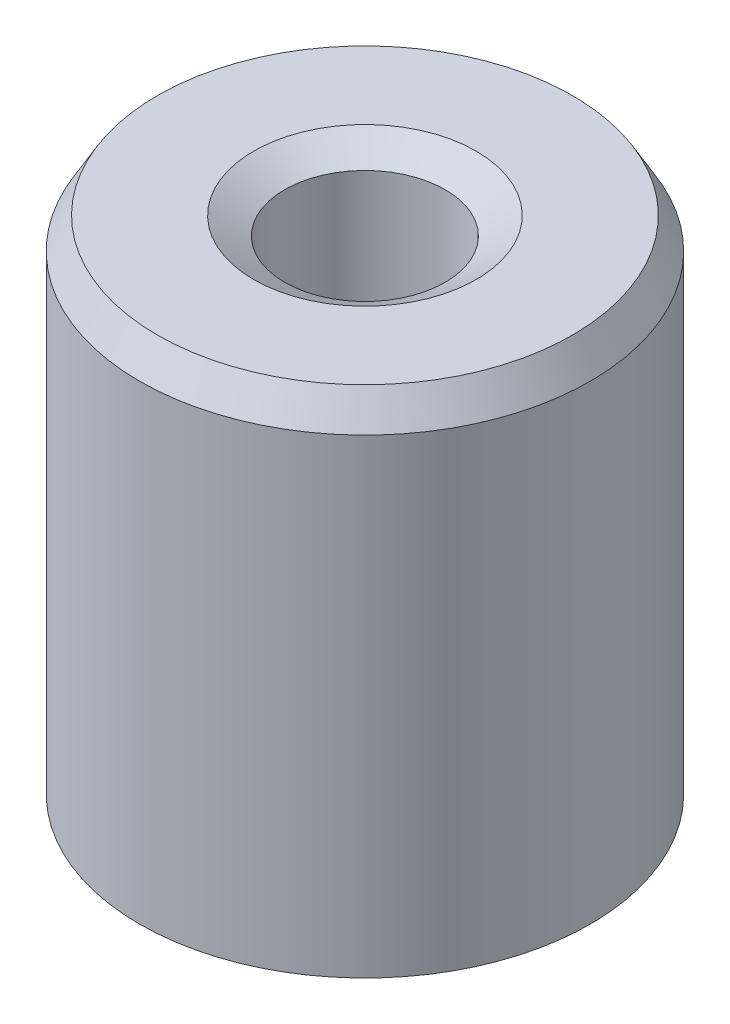
ISO-10303-21;
HEADER;
FILE_DESCRIPTION(('STEP AP214'),'2;1');
FILE_NAME('part.step','',(''),(''),'','','');
FILE_SCHEMA(('AUTOMOTIVE_DESIGN { 1 0 10303 214 1 1 1 1 }'));
ENDSEC;
DATA;
#1=APPLICATION_CONTEXT('core data for automotive mechanical design processes');
#2=APPLICATION_PROTOCOL_DEFINITION('international standard','automotive_design',2000,#1);
#3=PRODUCT_CONTEXT('',#1,'mechanical');
#4=PRODUCT('Part','Part','',(#3));
#5=PRODUCT_RELATED_PRODUCT_CATEGORY('part','',(#4));
#6=PRODUCT_DEFINITION_FORMATION('','',#4);
#7=PRODUCT_DEFINITION_CONTEXT('part definition',#1,'design');
#8=PRODUCT_DEFINITION('design','',#6,#7);
#9=PRODUCT_DEFINITION_SHAPE('','',#8);
#10=(LENGTH_UNIT() NAMED_UNIT(*) SI_UNIT(.MILLI.,.METRE.));
#11=(NAMED_UNIT(*) PLANE_ANGLE_UNIT() SI_UNIT($,.RADIAN.));
#12=(NAMED_UNIT(*) SI_UNIT($,.STERADIAN.) SOLID_ANGLE_UNIT());
#13=UNCERTAINTY_MEASURE_WITH_UNIT(LENGTH_MEASURE(1.E-05),#10,'distance_accuracy_value','');
#14=(GEOMETRIC_REPRESENTATION_CONTEXT(3) GLOBAL_UNCERTAINTY_ASSIGNED_CONTEXT((#13)) GLOBAL_UNIT_ASSIGNED_CONTEXT((#10,
#11,#12)) REPRESENTATION_CONTEXT('',''));
#15=CARTESIAN_POINT('',(0.,0.,0.));
#16=DIRECTION('',(0.,0.,1.));
#17=DIRECTION('',(1.,0.,0.));
#18=AXIS2_PLACEMENT_3D('',#15,#16,#17);
#19=CARTESIAN_POINT('',(0.,17.2736508764337,0.));
#20=DIRECTION('',(0.,-1.,0.));
#21=DIRECTION('',(0.,0.,-1.));
#22=AXIS2_PLACEMENT_3D('',#19,#20,#21);
#23=CYLINDRICAL_SURFACE('',#22,7.5);
#24=CARTESIAN_POINT('',(0.,0.595198792675698,0.));
#25=DIRECTION('',(0.,1.,0.));
#26=DIRECTION('',(0.,0.,1.));
#27=AXIS2_PLACEMENT_3D('',#24,#25,#26);
#28=CIRCLE('',#27,7.5);
#29=CARTESIAN_POINT('',(0.,0.595198792675698,7.5));
#30=VERTEX_POINT('',#29);
#31=EDGE_CURVE('E10',#30,#30,#28,.T.);
#32=ORIENTED_EDGE('',*,*,#31,.T.);
#33=EDGE_LOOP('',(#32));
#34=FACE_BOUND('',#33,.T.);
#35=CARTESIAN_POINT('',(0.,16.2427363269158,0.));
#36=DIRECTION('',(0.,1.,0.));
#37=DIRECTION('',(0.,0.,1.));
#38=AXIS2_PLACEMENT_3D('',#35,#36,#37);
#39=CIRCLE('',#38,7.5);
#40=CARTESIAN_POINT('',(0.,16.2427363269158,7.5));
#41=VERTEX_POINT('',#40);
#42=EDGE_CURVE('E50',#41,#41,#39,.F.);
#43=ORIENTED_EDGE('',*,*,#42,.T.);
#44=EDGE_LOOP('',(#43));
#45=FACE_BOUND('',#44,.T.);
#46=ADVANCED_FACE('F39',(#34,#45),#23,.T.);
#47=CARTESIAN_POINT('',(0.,17.2736508764337,0.));
#48=DIRECTION('',(0.,1.,0.));
#49=DIRECTION('',(0.,0.,1.));
#50=AXIS2_PLACEMENT_3D('',#47,#48,#49);
#51=PLANE('',#50);
#52=CARTESIAN_POINT('',(0.,17.2736508764337,0.));
#53=DIRECTION('',(0.,1.,0.));
#54=DIRECTION('',(0.,0.,1.));
#55=AXIS2_PLACEMENT_3D('',#52,#53,#54);
#56=CIRCLE('',#55,3.70264254471921);
#57=CARTESIAN_POINT('',(0.,17.2736508764337,3.70264254471921));
#58=VERTEX_POINT('',#57);
#59=EDGE_CURVE('E58',#58,#58,#56,.F.);
#60=ORIENTED_EDGE('',*,*,#59,.T.);
#61=EDGE_LOOP('',(#60));
#62=FACE_BOUND('',#61,.T.);
#63=CARTESIAN_POINT('',(0.,17.2736508764337,0.));
#64=DIRECTION('',(0.,1.,0.));
#65=DIRECTION('',(0.,0.,1.));
#66=AXIS2_PLACEMENT_3D('',#63,#64,#65);
#67=CIRCLE('',#66,6.9048012073243);
#68=CARTESIAN_POINT('',(0.,17.2736508764337,6.9048012073243));
#69=VERTEX_POINT('',#68);
#70=EDGE_CURVE('E61',#69,#69,#67,.T.);
#71=ORIENTED_EDGE('',*,*,#70,.T.);
#72=EDGE_LOOP('',(#71));
#73=FACE_BOUND('',#72,.T.);
#74=ADVANCED_FACE('F88',(#62,#73),#51,.T.);
#75=CARTESIAN_POINT('',(0.,0.,0.));
#76=DIRECTION('',(0.,1.,0.));
#77=DIRECTION('',(0.,0.,1.));
#78=AXIS2_PLACEMENT_3D('',#75,#76,#77);
#79=PLANE('',#78);
#80=CARTESIAN_POINT('',(0.,0.,0.));
#81=DIRECTION('',(0.,1.,0.));
#82=DIRECTION('',(0.,0.,1.));
#83=AXIS2_PLACEMENT_3D('',#80,#81,#82);
#84=CIRCLE('',#83,3.26692678787694);
#85=CARTESIAN_POINT('',(0.,0.,3.26692678787694));
#86=VERTEX_POINT('',#85);
#87=EDGE_CURVE('E51',#86,#86,#84,.T.);
#88=ORIENTED_EDGE('',*,*,#87,.T.);
#89=EDGE_LOOP('',(#88));
#90=FACE_BOUND('',#89,.T.);
#91=CARTESIAN_POINT('',(0.,0.,0.));
#92=DIRECTION('',(0.,1.,0.));
#93=DIRECTION('',(0.,0.,1.));
#94=AXIS2_PLACEMENT_3D('',#91,#92,#93);
#95=CIRCLE('',#94,6.46908545048203);
#96=CARTESIAN_POINT('',(0.,0.,6.46908545048203));
#97=VERTEX_POINT('',#96);
#98=EDGE_CURVE('E54',#97,#97,#95,.F.);
#99=ORIENTED_EDGE('',*,*,#98,.T.);
#100=EDGE_LOOP('',(#99));
#101=FACE_BOUND('',#100,.T.);
#102=ADVANCED_FACE('F83',(#90,#101),#79,.F.);
#103=CARTESIAN_POINT('',(0.,17.2736508764337,0.));
#104=DIRECTION('',(0.,-1.,0.));
#105=DIRECTION('',(0.,0.,-1.));
#106=AXIS2_PLACEMENT_3D('',#103,#104,#105);
#107=CYLINDRICAL_SURFACE('',#106,2.67172799520124);
#108=CARTESIAN_POINT('',(0.,16.678452083758,0.));
#109=DIRECTION('',(0.,1.,0.));
#110=DIRECTION('',(0.,0.,1.));
#111=AXIS2_PLACEMENT_3D('',#108,#109,#110);
#112=CIRCLE('',#111,2.67172799520124);
#113=CARTESIAN_POINT('',(0.,16.678452083758,2.67172799520124));
#114=VERTEX_POINT('',#113);
#115=EDGE_CURVE('E67',#114,#114,#112,.T.);
#116=ORIENTED_EDGE('',*,*,#115,.T.);
#117=EDGE_LOOP('',(#116));
#118=FACE_BOUND('',#117,.T.);
#119=CARTESIAN_POINT('',(0.,1.03091454951798,0.));
#120=DIRECTION('',(0.,1.,0.));
#121=DIRECTION('',(0.,0.,1.));
#122=AXIS2_PLACEMENT_3D('',#119,#120,#121);
#123=CIRCLE('',#122,2.67172799520124);
#124=CARTESIAN_POINT('',(0.,1.03091454951798,2.67172799520124));
#125=VERTEX_POINT('',#124);
#126=EDGE_CURVE('E69',#125,#125,#123,.F.);
#127=ORIENTED_EDGE('',*,*,#126,.T.);
#128=EDGE_LOOP('',(#127));
#129=FACE_BOUND('',#128,.T.);
#130=ADVANCED_FACE('F71',(#118,#129),#107,.F.);
#131=CARTESIAN_POINT('',(0.,16.678452083758,0.));
#132=DIRECTION('',(0.,1.,0.));
#133=DIRECTION('',(0.,0.,1.));
#134=AXIS2_PLACEMENT_3D('',#131,#132,#133);
#135=CONICAL_SURFACE('',#134,2.67172799520124,1.0471975511966);
#136=ORIENTED_EDGE('',*,*,#59,.F.);
#137=EDGE_LOOP('',(#136));
#138=FACE_BOUND('',#137,.T.);
#139=ORIENTED_EDGE('',*,*,#115,.F.);
#140=EDGE_LOOP('',(#139));
#141=FACE_BOUND('',#140,.T.);
#142=ADVANCED_FACE('F77',(#138,#141),#135,.F.);
#143=CARTESIAN_POINT('',(0.,0.,0.));
#144=DIRECTION('',(0.,-1.,0.));
#145=DIRECTION('',(0.,0.,-1.));
#146=AXIS2_PLACEMENT_3D('',#143,#144,#145);
#147=CONICAL_SURFACE('',#146,3.26692678787694,0.523598775598296);
#148=ORIENTED_EDGE('',*,*,#126,.F.);
#149=EDGE_LOOP('',(#148));
#150=FACE_BOUND('',#149,.T.);
#151=ORIENTED_EDGE('',*,*,#87,.F.);
#152=EDGE_LOOP('',(#151));
#153=FACE_BOUND('',#152,.T.);
#154=ADVANCED_FACE('F73',(#150,#153),#147,.F.);
#155=CARTESIAN_POINT('',(0.,0.595198792675698,0.));
#156=DIRECTION('',(0.,1.,0.));
#157=DIRECTION('',(0.,0.,1.));
#158=AXIS2_PLACEMENT_3D('',#155,#156,#157);
#159=CONICAL_SURFACE('',#158,7.5,1.0471975511966);
#160=ORIENTED_EDGE('',*,*,#98,.F.);
#161=EDGE_LOOP('',(#160));
#162=FACE_BOUND('',#161,.T.);
#163=ORIENTED_EDGE('',*,*,#31,.F.);
#164=EDGE_LOOP('',(#163));
#165=FACE_BOUND('',#164,.T.);
#166=ADVANCED_FACE('F76',(#162,#165),#159,.T.);
#167=CARTESIAN_POINT('',(0.,17.2736508764337,0.));
#168=DIRECTION('',(0.,-1.,0.));
#169=DIRECTION('',(0.,0.,-1.));
#170=AXIS2_PLACEMENT_3D('',#167,#168,#169);
#171=CONICAL_SURFACE('',#170,6.9048012073243,0.523598775598297);
#172=ORIENTED_EDGE('',*,*,#42,.F.);
#173=EDGE_LOOP('',(#172));
#174=FACE_BOUND('',#173,.T.);
#175=ORIENTED_EDGE('',*,*,#70,.F.);
#176=EDGE_LOOP('',(#175));
#177=FACE_BOUND('',#176,.T.);
#178=ADVANCED_FACE('F45',(#174,#177),#171,.T.);
#179=CLOSED_SHELL('',(#46,#74,#102,#130,#142,#154,#166,#178));
#180=MANIFOLD_SOLID_BREP('B2',#179);
#181=ADVANCED_BREP_SHAPE_REPRESENTATION('',(#18,#180),#14);
#182=SHAPE_DEFINITION_REPRESENTATION(#9,#181);
ENDSEC;
END-ISO-10303-21;
